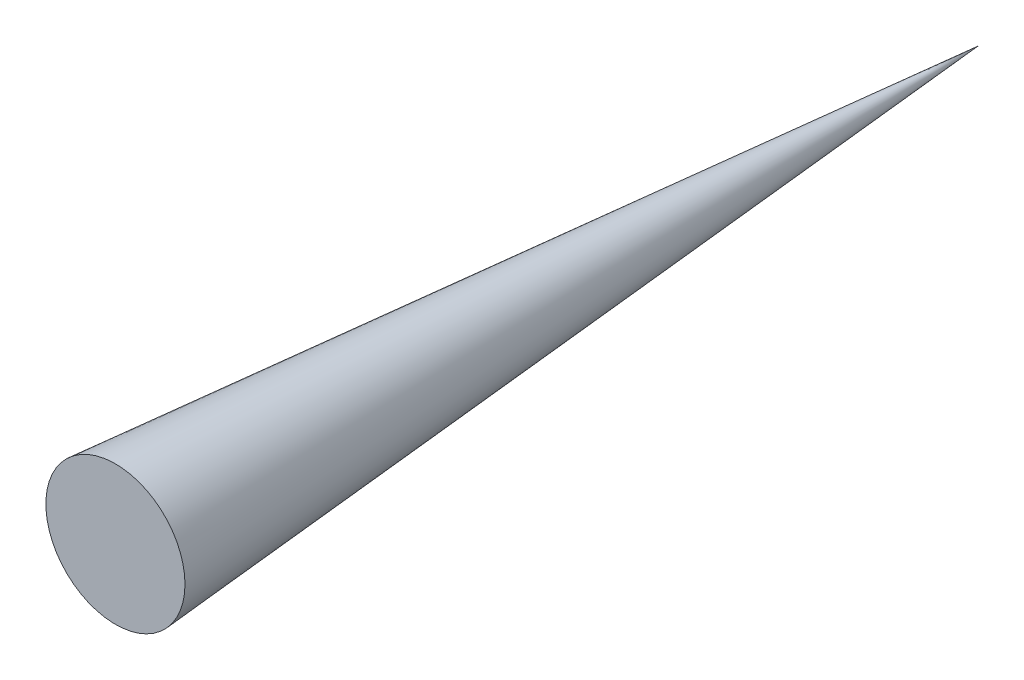
ISO-10303-21;
HEADER;
FILE_DESCRIPTION(('STEP AP214'),'2;1');
FILE_NAME('part.step','',(''),(''),'','','');
FILE_SCHEMA(('AUTOMOTIVE_DESIGN { 1 0 10303 214 1 1 1 1 }'));
ENDSEC;
DATA;
#1=APPLICATION_CONTEXT('core data for automotive mechanical design processes');
#2=APPLICATION_PROTOCOL_DEFINITION('international standard','automotive_design',2000,#1);
#3=PRODUCT_CONTEXT('',#1,'mechanical');
#4=PRODUCT('Part','Part','',(#3));
#5=PRODUCT_RELATED_PRODUCT_CATEGORY('part','',(#4));
#6=PRODUCT_DEFINITION_FORMATION('','',#4);
#7=PRODUCT_DEFINITION_CONTEXT('part definition',#1,'design');
#8=PRODUCT_DEFINITION('design','',#6,#7);
#9=PRODUCT_DEFINITION_SHAPE('','',#8);
#10=(LENGTH_UNIT() NAMED_UNIT(*) SI_UNIT(.MILLI.,.METRE.));
#11=(NAMED_UNIT(*) PLANE_ANGLE_UNIT() SI_UNIT($,.RADIAN.));
#12=(NAMED_UNIT(*) SI_UNIT($,.STERADIAN.) SOLID_ANGLE_UNIT());
#13=UNCERTAINTY_MEASURE_WITH_UNIT(LENGTH_MEASURE(1.E-05),#10,'distance_accuracy_value','');
#14=(GEOMETRIC_REPRESENTATION_CONTEXT(3) GLOBAL_UNCERTAINTY_ASSIGNED_CONTEXT((#13)) GLOBAL_UNIT_ASSIGNED_CONTEXT((#10,
#11,#12)) REPRESENTATION_CONTEXT('',''));
#15=CARTESIAN_POINT('',(0.,0.,0.));
#16=DIRECTION('',(0.,0.,1.));
#17=DIRECTION('',(1.,0.,0.));
#18=AXIS2_PLACEMENT_3D('',#15,#16,#17);
#19=CARTESIAN_POINT('',(0.,0.,-372.));
#20=DIRECTION('',(0.,0.,1.));
#21=DIRECTION('',(1.,0.,0.));
#22=AXIS2_PLACEMENT_3D('',#19,#20,#21);
#23=CONICAL_SURFACE('',#22,0.,0.0804710112654609);
#24=CARTESIAN_POINT('',(0.,0.,0.));
#25=DIRECTION('',(0.,0.,1.));
#26=DIRECTION('',(1.,0.,0.));
#27=AXIS2_PLACEMENT_3D('',#24,#25,#26);
#28=CIRCLE('',#27,30.);
#29=CARTESIAN_POINT('',(30.,0.,0.));
#30=VERTEX_POINT('',#29);
#31=EDGE_CURVE('E11',#30,#30,#28,.T.);
#32=ORIENTED_EDGE('',*,*,#31,.F.);
#33=EDGE_LOOP('',(#32));
#34=FACE_BOUND('',#33,.T.);
#35=CARTESIAN_POINT('',(0.,0.,-372.));
#36=VERTEX_POINT('',#35);
#37=VERTEX_LOOP('',#36);
#38=FACE_BOUND('',#37,.T.);
#39=ADVANCED_FACE('F39',(#34,#38),#23,.T.);
#40=CARTESIAN_POINT('',(0.,0.,0.));
#41=DIRECTION('',(0.,0.,-1.));
#42=DIRECTION('',(-1.,0.,0.));
#43=AXIS2_PLACEMENT_3D('',#40,#41,#42);
#44=PLANE('',#43);
#45=ORIENTED_EDGE('',*,*,#31,.T.);
#46=EDGE_LOOP('',(#45));
#47=FACE_BOUND('',#46,.T.);
#48=ADVANCED_FACE('F47',(#47),#44,.F.);
#49=CLOSED_SHELL('',(#39,#48));
#50=MANIFOLD_SOLID_BREP('B2',#49);
#51=ADVANCED_BREP_SHAPE_REPRESENTATION('',(#18,#50),#14);
#52=SHAPE_DEFINITION_REPRESENTATION(#9,#51);
ENDSEC;
END-ISO-10303-21;
